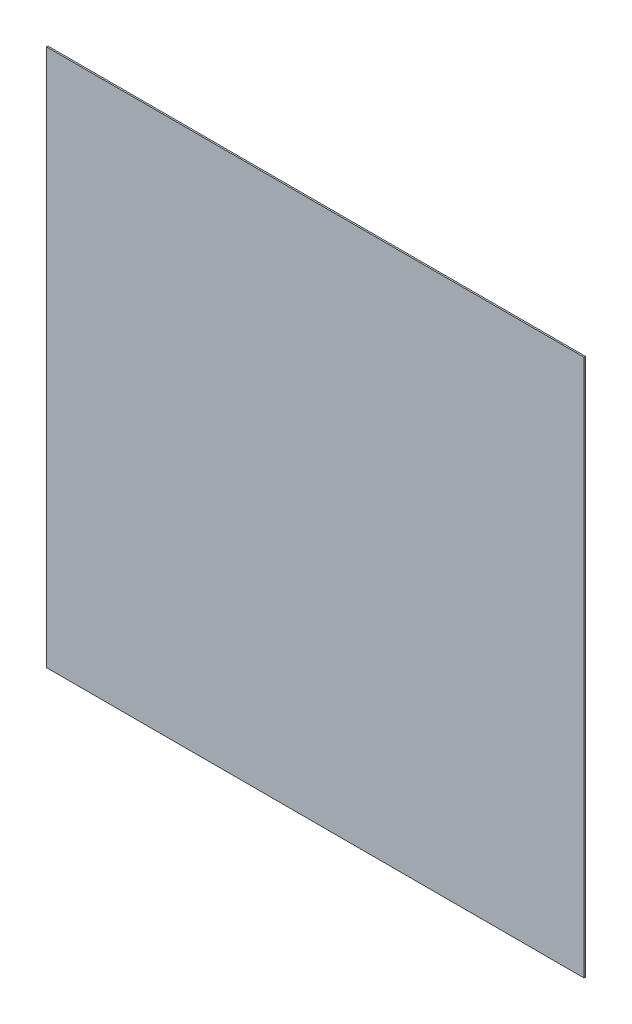
ISO-10303-21;
HEADER;
FILE_DESCRIPTION(('STEP AP214'),'2;1');
FILE_NAME('part.step','',(''),(''),'','','');
FILE_SCHEMA(('AUTOMOTIVE_DESIGN { 1 0 10303 214 1 1 1 1 }'));
ENDSEC;
DATA;
#1=APPLICATION_CONTEXT('core data for automotive mechanical design processes');
#2=APPLICATION_PROTOCOL_DEFINITION('international standard','automotive_design',2000,#1);
#3=PRODUCT_CONTEXT('',#1,'mechanical');
#4=PRODUCT('Part','Part','',(#3));
#5=PRODUCT_RELATED_PRODUCT_CATEGORY('part','',(#4));
#6=PRODUCT_DEFINITION_FORMATION('','',#4);
#7=PRODUCT_DEFINITION_CONTEXT('part definition',#1,'design');
#8=PRODUCT_DEFINITION('design','',#6,#7);
#9=PRODUCT_DEFINITION_SHAPE('','',#8);
#10=(LENGTH_UNIT() NAMED_UNIT(*) SI_UNIT(.MILLI.,.METRE.));
#11=(NAMED_UNIT(*) PLANE_ANGLE_UNIT() SI_UNIT($,.RADIAN.));
#12=(NAMED_UNIT(*) SI_UNIT($,.STERADIAN.) SOLID_ANGLE_UNIT());
#13=UNCERTAINTY_MEASURE_WITH_UNIT(LENGTH_MEASURE(1.E-05),#10,'distance_accuracy_value','');
#14=(GEOMETRIC_REPRESENTATION_CONTEXT(3) GLOBAL_UNCERTAINTY_ASSIGNED_CONTEXT((#13)) GLOBAL_UNIT_ASSIGNED_CONTEXT((#10,
#11,#12)) REPRESENTATION_CONTEXT('',''));
#15=CARTESIAN_POINT('',(0.,0.,0.));
#16=DIRECTION('',(0.,0.,1.));
#17=DIRECTION('',(1.,0.,0.));
#18=AXIS2_PLACEMENT_3D('',#15,#16,#17);
#19=CARTESIAN_POINT('',(360.,360.,2.));
#20=DIRECTION('',(-1.,0.,0.));
#21=DIRECTION('',(0.,-1.,0.));
#22=AXIS2_PLACEMENT_3D('',#19,#20,#21);
#23=PLANE('',#22);
#24=DIRECTION('',(0.,1.,0.));
#25=VECTOR('',#24,1.);
#26=CARTESIAN_POINT('',(360.,360.,0.));
#27=LINE('',#26,#25);
#28=CARTESIAN_POINT('',(360.,-360.,0.));
#29=VERTEX_POINT('',#28);
#30=CARTESIAN_POINT('',(360.,360.,0.));
#31=VERTEX_POINT('',#30);
#32=EDGE_CURVE('E108',#29,#31,#27,.T.);
#33=ORIENTED_EDGE('',*,*,#32,.T.);
#34=DIRECTION('',(0.,0.,-1.));
#35=VECTOR('',#34,1.);
#36=CARTESIAN_POINT('',(360.,360.,2.));
#37=LINE('',#36,#35);
#38=CARTESIAN_POINT('',(360.,360.,2.));
#39=VERTEX_POINT('',#38);
#40=EDGE_CURVE('E99',#39,#31,#37,.T.);
#41=ORIENTED_EDGE('',*,*,#40,.F.);
#42=DIRECTION('',(0.,1.,0.));
#43=VECTOR('',#42,1.);
#44=CARTESIAN_POINT('',(360.,360.,2.));
#45=LINE('',#44,#43);
#46=CARTESIAN_POINT('',(360.,-360.,2.));
#47=VERTEX_POINT('',#46);
#48=EDGE_CURVE('E93',#47,#39,#45,.T.);
#49=ORIENTED_EDGE('',*,*,#48,.F.);
#50=DIRECTION('',(0.,0.,-1.));
#51=VECTOR('',#50,1.);
#52=CARTESIAN_POINT('',(360.,-360.,2.));
#53=LINE('',#52,#51);
#54=EDGE_CURVE('E104',#47,#29,#53,.T.);
#55=ORIENTED_EDGE('',*,*,#54,.T.);
#56=EDGE_LOOP('',(#33,#41,#49,#55));
#57=FACE_BOUND('',#56,.T.);
#58=ADVANCED_FACE('F41',(#57),#23,.F.);
#59=CARTESIAN_POINT('',(-360.,360.,2.));
#60=DIRECTION('',(0.,-1.,0.));
#61=DIRECTION('',(0.,0.,-1.));
#62=AXIS2_PLACEMENT_3D('',#59,#60,#61);
#63=PLANE('',#62);
#64=DIRECTION('',(-1.,0.,0.));
#65=VECTOR('',#64,1.);
#66=CARTESIAN_POINT('',(-360.,360.,0.));
#67=LINE('',#66,#65);
#68=CARTESIAN_POINT('',(-360.,360.,0.));
#69=VERTEX_POINT('',#68);
#70=EDGE_CURVE('E98',#31,#69,#67,.T.);
#71=ORIENTED_EDGE('',*,*,#70,.T.);
#72=DIRECTION('',(0.,0.,-1.));
#73=VECTOR('',#72,1.);
#74=CARTESIAN_POINT('',(-360.,360.,2.));
#75=LINE('',#74,#73);
#76=CARTESIAN_POINT('',(-360.,360.,2.));
#77=VERTEX_POINT('',#76);
#78=EDGE_CURVE('E96',#77,#69,#75,.T.);
#79=ORIENTED_EDGE('',*,*,#78,.F.);
#80=DIRECTION('',(-1.,0.,0.));
#81=VECTOR('',#80,1.);
#82=CARTESIAN_POINT('',(-360.,360.,2.));
#83=LINE('',#82,#81);
#84=EDGE_CURVE('E88',#39,#77,#83,.T.);
#85=ORIENTED_EDGE('',*,*,#84,.F.);
#86=ORIENTED_EDGE('',*,*,#40,.T.);
#87=EDGE_LOOP('',(#71,#79,#85,#86));
#88=FACE_BOUND('',#87,.T.);
#89=ADVANCED_FACE('F97',(#88),#63,.F.);
#90=CARTESIAN_POINT('',(-360.,360.,2.));
#91=DIRECTION('',(1.,0.,0.));
#92=DIRECTION('',(0.,1.,0.));
#93=AXIS2_PLACEMENT_3D('',#90,#91,#92);
#94=PLANE('',#93);
#95=DIRECTION('',(0.,-1.,0.));
#96=VECTOR('',#95,1.);
#97=CARTESIAN_POINT('',(-360.,360.,0.));
#98=LINE('',#97,#96);
#99=CARTESIAN_POINT('',(-360.,-360.,0.));
#100=VERTEX_POINT('',#99);
#101=EDGE_CURVE('E74',#69,#100,#98,.T.);
#102=ORIENTED_EDGE('',*,*,#101,.T.);
#103=DIRECTION('',(0.,0.,-1.));
#104=VECTOR('',#103,1.);
#105=CARTESIAN_POINT('',(-360.,-360.,2.));
#106=LINE('',#105,#104);
#107=CARTESIAN_POINT('',(-360.,-360.,2.));
#108=VERTEX_POINT('',#107);
#109=EDGE_CURVE('E100',#108,#100,#106,.T.);
#110=ORIENTED_EDGE('',*,*,#109,.F.);
#111=DIRECTION('',(0.,-1.,0.));
#112=VECTOR('',#111,1.);
#113=CARTESIAN_POINT('',(-360.,360.,2.));
#114=LINE('',#113,#112);
#115=EDGE_CURVE('E91',#77,#108,#114,.T.);
#116=ORIENTED_EDGE('',*,*,#115,.F.);
#117=ORIENTED_EDGE('',*,*,#78,.T.);
#118=EDGE_LOOP('',(#102,#110,#116,#117));
#119=FACE_BOUND('',#118,.T.);
#120=ADVANCED_FACE('F102',(#119),#94,.F.);
#121=CARTESIAN_POINT('',(-360.,-360.,2.));
#122=DIRECTION('',(0.,1.,0.));
#123=DIRECTION('',(0.,0.,1.));
#124=AXIS2_PLACEMENT_3D('',#121,#122,#123);
#125=PLANE('',#124);
#126=DIRECTION('',(1.,0.,0.));
#127=VECTOR('',#126,1.);
#128=CARTESIAN_POINT('',(-360.,-360.,0.));
#129=LINE('',#128,#127);
#130=EDGE_CURVE('E80',#100,#29,#129,.T.);
#131=ORIENTED_EDGE('',*,*,#130,.T.);
#132=ORIENTED_EDGE('',*,*,#54,.F.);
#133=DIRECTION('',(1.,0.,0.));
#134=VECTOR('',#133,1.);
#135=CARTESIAN_POINT('',(-360.,-360.,2.));
#136=LINE('',#135,#134);
#137=EDGE_CURVE('E57',#108,#47,#136,.T.);
#138=ORIENTED_EDGE('',*,*,#137,.F.);
#139=ORIENTED_EDGE('',*,*,#109,.T.);
#140=EDGE_LOOP('',(#131,#132,#138,#139));
#141=FACE_BOUND('',#140,.T.);
#142=ADVANCED_FACE('F140',(#141),#125,.F.);
#143=CARTESIAN_POINT('',(0.,0.,2.));
#144=DIRECTION('',(0.,0.,1.));
#145=DIRECTION('',(1.,0.,0.));
#146=AXIS2_PLACEMENT_3D('',#143,#144,#145);
#147=PLANE('',#146);
#148=ORIENTED_EDGE('',*,*,#48,.T.);
#149=ORIENTED_EDGE('',*,*,#84,.T.);
#150=ORIENTED_EDGE('',*,*,#115,.T.);
#151=ORIENTED_EDGE('',*,*,#137,.T.);
#152=EDGE_LOOP('',(#148,#149,#150,#151));
#153=FACE_BOUND('',#152,.T.);
#154=ADVANCED_FACE('F89',(#153),#147,.T.);
#155=CARTESIAN_POINT('',(0.,0.,0.));
#156=DIRECTION('',(0.,0.,1.));
#157=DIRECTION('',(1.,0.,0.));
#158=AXIS2_PLACEMENT_3D('',#155,#156,#157);
#159=PLANE('',#158);
#160=CARTESIAN_POINT('',(-340.,0.,0.));
#161=DIRECTION('',(0.,0.,1.));
#162=DIRECTION('',(1.,0.,0.));
#163=AXIS2_PLACEMENT_3D('',#160,#161,#162);
#164=CIRCLE('',#163,4.99999999999999);
#165=CARTESIAN_POINT('',(-335.,0.,0.));
#166=VERTEX_POINT('',#165);
#167=EDGE_CURVE('E11',#166,#166,#164,.F.);
#168=ORIENTED_EDGE('',*,*,#167,.F.);
#169=EDGE_LOOP('',(#168));
#170=FACE_BOUND('',#169,.T.);
#171=CARTESIAN_POINT('',(0.,-340.,0.));
#172=DIRECTION('',(0.,0.,1.));
#173=DIRECTION('',(1.,0.,0.));
#174=AXIS2_PLACEMENT_3D('',#171,#172,#173);
#175=CIRCLE('',#174,5.00000000000001);
#176=CARTESIAN_POINT('',(5.00000000000006,-340.,0.));
#177=VERTEX_POINT('',#176);
#178=EDGE_CURVE('E49',#177,#177,#175,.F.);
#179=ORIENTED_EDGE('',*,*,#178,.F.);
#180=EDGE_LOOP('',(#179));
#181=FACE_BOUND('',#180,.T.);
#182=CARTESIAN_POINT('',(340.,0.,0.));
#183=DIRECTION('',(0.,0.,1.));
#184=DIRECTION('',(1.,0.,0.));
#185=AXIS2_PLACEMENT_3D('',#182,#183,#184);
#186=CIRCLE('',#185,4.99999999999999);
#187=CARTESIAN_POINT('',(345.,0.,0.));
#188=VERTEX_POINT('',#187);
#189=EDGE_CURVE('E121',#188,#188,#186,.F.);
#190=ORIENTED_EDGE('',*,*,#189,.F.);
#191=EDGE_LOOP('',(#190));
#192=FACE_BOUND('',#191,.T.);
#193=CARTESIAN_POINT('',(0.,340.,0.));
#194=DIRECTION('',(0.,0.,1.));
#195=DIRECTION('',(1.,0.,0.));
#196=AXIS2_PLACEMENT_3D('',#193,#194,#195);
#197=CIRCLE('',#196,5.00000000000001);
#198=CARTESIAN_POINT('',(5.00000000000006,340.,0.));
#199=VERTEX_POINT('',#198);
#200=EDGE_CURVE('E118',#199,#199,#197,.F.);
#201=ORIENTED_EDGE('',*,*,#200,.F.);
#202=EDGE_LOOP('',(#201));
#203=FACE_BOUND('',#202,.T.);
#204=ORIENTED_EDGE('',*,*,#32,.F.);
#205=ORIENTED_EDGE('',*,*,#130,.F.);
#206=ORIENTED_EDGE('',*,*,#101,.F.);
#207=ORIENTED_EDGE('',*,*,#70,.F.);
#208=EDGE_LOOP('',(#204,#205,#206,#207));
#209=FACE_BOUND('',#208,.T.);
#210=ADVANCED_FACE('F128',(#170,#181,#192,#203,#209),#159,.F.);
#211=CARTESIAN_POINT('',(0.,340.,-2.));
#212=DIRECTION('',(0.,0.,1.));
#213=DIRECTION('',(1.,0.,0.));
#214=AXIS2_PLACEMENT_3D('',#211,#212,#213);
#215=CYLINDRICAL_SURFACE('',#214,5.00000000000001);
#216=CARTESIAN_POINT('',(0.,340.,-2.));
#217=DIRECTION('',(0.,0.,-1.));
#218=DIRECTION('',(-1.,0.,0.));
#219=AXIS2_PLACEMENT_3D('',#216,#217,#218);
#220=CIRCLE('',#219,5.00000000000001);
#221=CARTESIAN_POINT('',(-4.99999999999995,340.,-2.));
#222=VERTEX_POINT('',#221);
#223=EDGE_CURVE('E111',#222,#222,#220,.T.);
#224=ORIENTED_EDGE('',*,*,#223,.F.);
#225=EDGE_LOOP('',(#224));
#226=FACE_BOUND('',#225,.T.);
#227=ORIENTED_EDGE('',*,*,#200,.T.);
#228=EDGE_LOOP('',(#227));
#229=FACE_BOUND('',#228,.T.);
#230=ADVANCED_FACE('F131',(#226,#229),#215,.T.);
#231=CARTESIAN_POINT('',(0.,340.,-2.));
#232=DIRECTION('',(0.,0.,-1.));
#233=DIRECTION('',(-1.,0.,0.));
#234=AXIS2_PLACEMENT_3D('',#231,#232,#233);
#235=PLANE('',#234);
#236=ORIENTED_EDGE('',*,*,#223,.T.);
#237=EDGE_LOOP('',(#236));
#238=FACE_BOUND('',#237,.T.);
#239=ADVANCED_FACE('F188',(#238),#235,.T.);
#240=CARTESIAN_POINT('',(340.,0.,-2.));
#241=DIRECTION('',(0.,0.,1.));
#242=DIRECTION('',(1.,0.,0.));
#243=AXIS2_PLACEMENT_3D('',#240,#241,#242);
#244=CYLINDRICAL_SURFACE('',#243,4.99999999999999);
#245=CARTESIAN_POINT('',(340.,0.,-2.));
#246=DIRECTION('',(0.,0.,-1.));
#247=DIRECTION('',(-1.,0.,0.));
#248=AXIS2_PLACEMENT_3D('',#245,#246,#247);
#249=CIRCLE('',#248,4.99999999999999);
#250=CARTESIAN_POINT('',(335.,0.,-2.));
#251=VERTEX_POINT('',#250);
#252=EDGE_CURVE('E297',#251,#251,#249,.T.);
#253=ORIENTED_EDGE('',*,*,#252,.F.);
#254=EDGE_LOOP('',(#253));
#255=FACE_BOUND('',#254,.T.);
#256=ORIENTED_EDGE('',*,*,#189,.T.);
#257=EDGE_LOOP('',(#256));
#258=FACE_BOUND('',#257,.T.);
#259=ADVANCED_FACE('F199',(#255,#258),#244,.T.);
#260=CARTESIAN_POINT('',(340.,0.,-2.));
#261=DIRECTION('',(0.,0.,-1.));
#262=DIRECTION('',(-1.,0.,0.));
#263=AXIS2_PLACEMENT_3D('',#260,#261,#262);
#264=PLANE('',#263);
#265=ORIENTED_EDGE('',*,*,#252,.T.);
#266=EDGE_LOOP('',(#265));
#267=FACE_BOUND('',#266,.T.);
#268=ADVANCED_FACE('F210',(#267),#264,.T.);
#269=CARTESIAN_POINT('',(0.,-340.,-2.));
#270=DIRECTION('',(0.,0.,1.));
#271=DIRECTION('',(1.,0.,0.));
#272=AXIS2_PLACEMENT_3D('',#269,#270,#271);
#273=CYLINDRICAL_SURFACE('',#272,5.00000000000001);
#274=CARTESIAN_POINT('',(0.,-340.,-2.));
#275=DIRECTION('',(0.,0.,-1.));
#276=DIRECTION('',(1.,0.,0.));
#277=AXIS2_PLACEMENT_3D('',#274,#275,#276);
#278=CIRCLE('',#277,5.00000000000001);
#279=CARTESIAN_POINT('',(5.00000000000006,-340.,-2.));
#280=VERTEX_POINT('',#279);
#281=EDGE_CURVE('E294',#280,#280,#278,.T.);
#282=ORIENTED_EDGE('',*,*,#281,.F.);
#283=EDGE_LOOP('',(#282));
#284=FACE_BOUND('',#283,.T.);
#285=ORIENTED_EDGE('',*,*,#178,.T.);
#286=EDGE_LOOP('',(#285));
#287=FACE_BOUND('',#286,.T.);
#288=ADVANCED_FACE('F126',(#284,#287),#273,.T.);
#289=CARTESIAN_POINT('',(0.,-340.,-2.));
#290=DIRECTION('',(0.,0.,1.));
#291=DIRECTION('',(1.,0.,0.));
#292=AXIS2_PLACEMENT_3D('',#289,#290,#291);
#293=PLANE('',#292);
#294=ORIENTED_EDGE('',*,*,#281,.T.);
#295=EDGE_LOOP('',(#294));
#296=FACE_BOUND('',#295,.T.);
#297=ADVANCED_FACE('F231',(#296),#293,.F.);
#298=CARTESIAN_POINT('',(-340.,0.,-2.));
#299=DIRECTION('',(0.,0.,1.));
#300=DIRECTION('',(1.,0.,0.));
#301=AXIS2_PLACEMENT_3D('',#298,#299,#300);
#302=CYLINDRICAL_SURFACE('',#301,4.99999999999999);
#303=CARTESIAN_POINT('',(-340.,0.,-2.));
#304=DIRECTION('',(0.,0.,-1.));
#305=DIRECTION('',(1.,0.,0.));
#306=AXIS2_PLACEMENT_3D('',#303,#304,#305);
#307=CIRCLE('',#306,4.99999999999999);
#308=CARTESIAN_POINT('',(-335.,0.,-2.));
#309=VERTEX_POINT('',#308);
#310=EDGE_CURVE('E293',#309,#309,#307,.T.);
#311=ORIENTED_EDGE('',*,*,#310,.F.);
#312=EDGE_LOOP('',(#311));
#313=FACE_BOUND('',#312,.T.);
#314=ORIENTED_EDGE('',*,*,#167,.T.);
#315=EDGE_LOOP('',(#314));
#316=FACE_BOUND('',#315,.T.);
#317=ADVANCED_FACE('F242',(#313,#316),#302,.T.);
#318=CARTESIAN_POINT('',(-340.,0.,-2.));
#319=DIRECTION('',(0.,0.,1.));
#320=DIRECTION('',(1.,0.,0.));
#321=AXIS2_PLACEMENT_3D('',#318,#319,#320);
#322=PLANE('',#321);
#323=ORIENTED_EDGE('',*,*,#310,.T.);
#324=EDGE_LOOP('',(#323));
#325=FACE_BOUND('',#324,.T.);
#326=ADVANCED_FACE('F253',(#325),#322,.F.);
#327=CLOSED_SHELL('',(#58,#89,#120,#142,#154,#210,#230,#239,#259,#268,#288,#297,#317,#326));
#328=MANIFOLD_SOLID_BREP('B2',#327);
#329=ADVANCED_BREP_SHAPE_REPRESENTATION('',(#18,#328),#14);
#330=SHAPE_DEFINITION_REPRESENTATION(#9,#329);
ENDSEC;
END-ISO-10303-21;
